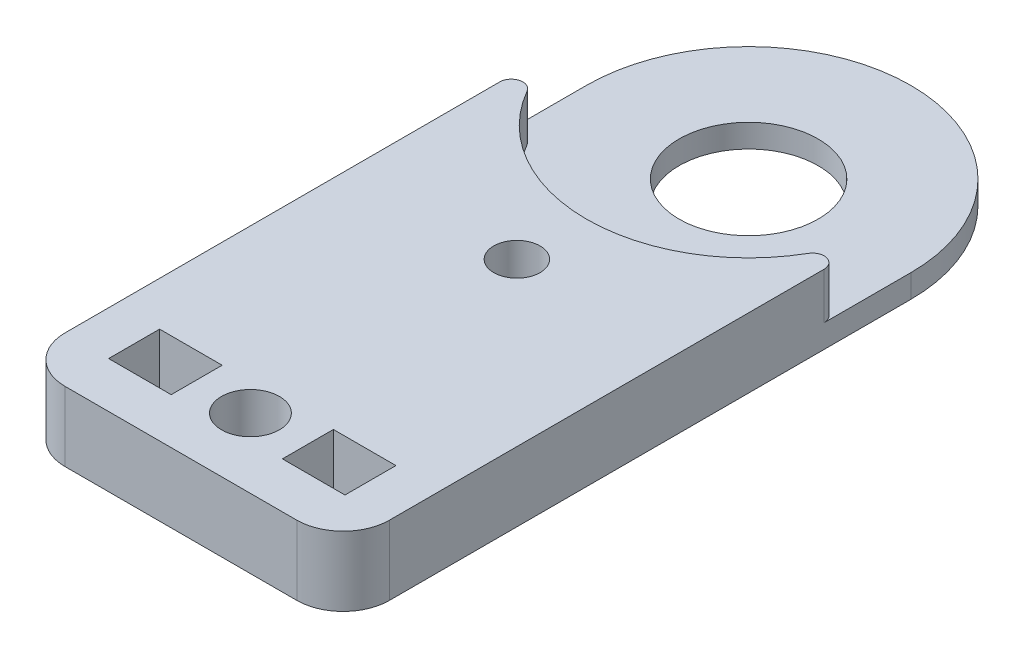
ISO-10303-21;
HEADER;
FILE_DESCRIPTION(('STEP AP214'),'2;1');
FILE_NAME('part.step','',(''),(''),'','','');
FILE_SCHEMA(('AUTOMOTIVE_DESIGN { 1 0 10303 214 1 1 1 1 }'));
ENDSEC;
DATA;
#1=APPLICATION_CONTEXT('core data for automotive mechanical design processes');
#2=APPLICATION_PROTOCOL_DEFINITION('international standard','automotive_design',2000,#1);
#3=PRODUCT_CONTEXT('',#1,'mechanical');
#4=PRODUCT('Part','Part','',(#3));
#5=PRODUCT_RELATED_PRODUCT_CATEGORY('part','',(#4));
#6=PRODUCT_DEFINITION_FORMATION('','',#4);
#7=PRODUCT_DEFINITION_CONTEXT('part definition',#1,'design');
#8=PRODUCT_DEFINITION('design','',#6,#7);
#9=PRODUCT_DEFINITION_SHAPE('','',#8);
#10=(LENGTH_UNIT() NAMED_UNIT(*) SI_UNIT(.MILLI.,.METRE.));
#11=(NAMED_UNIT(*) PLANE_ANGLE_UNIT() SI_UNIT($,.RADIAN.));
#12=(NAMED_UNIT(*) SI_UNIT($,.STERADIAN.) SOLID_ANGLE_UNIT());
#13=UNCERTAINTY_MEASURE_WITH_UNIT(LENGTH_MEASURE(1.E-05),#10,'distance_accuracy_value','');
#14=(GEOMETRIC_REPRESENTATION_CONTEXT(3) GLOBAL_UNCERTAINTY_ASSIGNED_CONTEXT((#13)) GLOBAL_UNIT_ASSIGNED_CONTEXT((#10,
#11,#12)) REPRESENTATION_CONTEXT('',''));
#15=CARTESIAN_POINT('',(0.,0.,0.));
#16=DIRECTION('',(0.,0.,1.));
#17=DIRECTION('',(1.,0.,0.));
#18=AXIS2_PLACEMENT_3D('',#15,#16,#17);
#19=CARTESIAN_POINT('',(0.,1.,-12.25));
#20=DIRECTION('',(0.,-1.,0.));
#21=DIRECTION('',(0.,0.,-1.));
#22=AXIS2_PLACEMENT_3D('',#19,#20,#21);
#23=CYLINDRICAL_SURFACE('',#22,7.);
#24=CARTESIAN_POINT('',(0.,1.,-12.25));
#25=DIRECTION('',(0.,1.,0.));
#26=DIRECTION('',(0.,0.,1.));
#27=AXIS2_PLACEMENT_3D('',#24,#25,#26);
#28=CIRCLE('',#27,7.);
#29=CARTESIAN_POINT('',(7.,1.,-12.25));
#30=VERTEX_POINT('',#29);
#31=CARTESIAN_POINT('',(-7.,1.,-12.25));
#32=VERTEX_POINT('',#31);
#33=EDGE_CURVE('E262',#30,#32,#28,.T.);
#34=ORIENTED_EDGE('',*,*,#33,.F.);
#35=DIRECTION('',(0.,-1.,0.));
#36=VECTOR('',#35,1.);
#37=CARTESIAN_POINT('',(7.,3.,-12.25));
#38=LINE('',#37,#36);
#39=CARTESIAN_POINT('',(7.,0.,-12.25));
#40=VERTEX_POINT('',#39);
#41=EDGE_CURVE('E251',#30,#40,#38,.T.);
#42=ORIENTED_EDGE('',*,*,#41,.T.);
#43=CARTESIAN_POINT('',(0.,0.,-12.25));
#44=DIRECTION('',(0.,1.,0.));
#45=DIRECTION('',(0.,0.,1.));
#46=AXIS2_PLACEMENT_3D('',#43,#44,#45);
#47=CIRCLE('',#46,7.);
#48=CARTESIAN_POINT('',(-7.,0.,-12.25));
#49=VERTEX_POINT('',#48);
#50=EDGE_CURVE('E261',#40,#49,#47,.T.);
#51=ORIENTED_EDGE('',*,*,#50,.T.);
#52=DIRECTION('',(0.,-1.,0.));
#53=VECTOR('',#52,1.);
#54=CARTESIAN_POINT('',(-7.,3.,-12.25));
#55=LINE('',#54,#53);
#56=EDGE_CURVE('E204',#32,#49,#55,.T.);
#57=ORIENTED_EDGE('',*,*,#56,.F.);
#58=EDGE_LOOP('',(#34,#42,#51,#57));
#59=FACE_BOUND('',#58,.T.);
#60=ADVANCED_FACE('F36',(#59),#23,.T.);
#61=CARTESIAN_POINT('',(0.,1.,-12.25));
#62=DIRECTION('',(0.,-1.,0.));
#63=DIRECTION('',(0.,0.,-1.));
#64=AXIS2_PLACEMENT_3D('',#61,#62,#63);
#65=CYLINDRICAL_SURFACE('',#64,3.);
#66=CARTESIAN_POINT('',(0.,1.,-12.25));
#67=DIRECTION('',(0.,1.,0.));
#68=DIRECTION('',(0.,0.,1.));
#69=AXIS2_PLACEMENT_3D('',#66,#67,#68);
#70=CIRCLE('',#69,3.);
#71=CARTESIAN_POINT('',(0.,1.,-9.25));
#72=VERTEX_POINT('',#71);
#73=EDGE_CURVE('E265',#72,#72,#70,.T.);
#74=ORIENTED_EDGE('',*,*,#73,.T.);
#75=EDGE_LOOP('',(#74));
#76=FACE_BOUND('',#75,.T.);
#77=CARTESIAN_POINT('',(0.,0.,-12.25));
#78=DIRECTION('',(0.,1.,0.));
#79=DIRECTION('',(0.,0.,1.));
#80=AXIS2_PLACEMENT_3D('',#77,#78,#79);
#81=CIRCLE('',#80,3.);
#82=CARTESIAN_POINT('',(0.,0.,-9.25));
#83=VERTEX_POINT('',#82);
#84=EDGE_CURVE('E266',#83,#83,#81,.T.);
#85=ORIENTED_EDGE('',*,*,#84,.F.);
#86=EDGE_LOOP('',(#85));
#87=FACE_BOUND('',#86,.T.);
#88=ADVANCED_FACE('F404',(#76,#87),#65,.F.);
#89=CARTESIAN_POINT('',(0.,1.,0.));
#90=DIRECTION('',(0.,1.,0.));
#91=DIRECTION('',(0.,0.,1.));
#92=AXIS2_PLACEMENT_3D('',#89,#90,#91);
#93=PLANE('',#92);
#94=ORIENTED_EDGE('',*,*,#33,.T.);
#95=DIRECTION('',(0.,0.,-1.));
#96=VECTOR('',#95,1.);
#97=CARTESIAN_POINT('',(-7.,1.,0.));
#98=LINE('',#97,#96);
#99=CARTESIAN_POINT('',(-7.,1.,-8.50834261322606));
#100=VERTEX_POINT('',#99);
#101=EDGE_CURVE('E289',#100,#32,#98,.T.);
#102=ORIENTED_EDGE('',*,*,#101,.F.);
#103=CARTESIAN_POINT('',(-6.5,1.,-8.50834261322606));
#104=DIRECTION('',(0.,1.,0.));
#105=DIRECTION('',(0.,0.,1.));
#106=AXIS2_PLACEMENT_3D('',#103,#104,#105);
#107=CIRCLE('',#106,0.5);
#108=CARTESIAN_POINT('',(-6.06666666666667,1.,-8.75778643901099));
#109=VERTEX_POINT('',#108);
#110=EDGE_CURVE('E296',#100,#109,#107,.F.);
#111=ORIENTED_EDGE('',*,*,#110,.T.);
#112=CARTESIAN_POINT('',(0.,1.,-12.25));
#113=DIRECTION('',(0.,1.,0.));
#114=DIRECTION('',(0.,0.,1.));
#115=AXIS2_PLACEMENT_3D('',#112,#113,#114);
#116=CIRCLE('',#115,7.);
#117=CARTESIAN_POINT('',(6.06666666666667,1.,-8.75778643901099));
#118=VERTEX_POINT('',#117);
#119=EDGE_CURVE('E247',#118,#109,#116,.F.);
#120=ORIENTED_EDGE('',*,*,#119,.F.);
#121=CARTESIAN_POINT('',(6.5,1.,-8.50834261322606));
#122=DIRECTION('',(0.,1.,0.));
#123=DIRECTION('',(0.,0.,1.));
#124=AXIS2_PLACEMENT_3D('',#121,#122,#123);
#125=CIRCLE('',#124,0.5);
#126=CARTESIAN_POINT('',(7.,1.,-8.50834261322606));
#127=VERTEX_POINT('',#126);
#128=EDGE_CURVE('E294',#118,#127,#125,.F.);
#129=ORIENTED_EDGE('',*,*,#128,.T.);
#130=DIRECTION('',(0.,0.,1.));
#131=VECTOR('',#130,1.);
#132=CARTESIAN_POINT('',(7.,1.,0.));
#133=LINE('',#132,#131);
#134=EDGE_CURVE('E281',#30,#127,#133,.T.);
#135=ORIENTED_EDGE('',*,*,#134,.F.);
#136=EDGE_LOOP('',(#94,#102,#111,#120,#129,#135));
#137=FACE_BOUND('',#136,.T.);
#138=ORIENTED_EDGE('',*,*,#73,.F.);
#139=EDGE_LOOP('',(#138));
#140=FACE_BOUND('',#139,.T.);
#141=ADVANCED_FACE('F340',(#137,#140),#93,.T.);
#142=CARTESIAN_POINT('',(0.,0.,0.));
#143=DIRECTION('',(0.,1.,0.));
#144=DIRECTION('',(0.,0.,1.));
#145=AXIS2_PLACEMENT_3D('',#142,#143,#144);
#146=PLANE('',#145);
#147=DIRECTION('',(0.,0.,-1.));
#148=VECTOR('',#147,1.);
#149=CARTESIAN_POINT('',(7.,0.,0.));
#150=LINE('',#149,#148);
#151=CARTESIAN_POINT('',(7.,0.,10.25));
#152=VERTEX_POINT('',#151);
#153=EDGE_CURVE('E211',#152,#40,#150,.T.);
#154=ORIENTED_EDGE('',*,*,#153,.F.);
#155=CARTESIAN_POINT('',(5.,0.,10.25));
#156=DIRECTION('',(0.,1.,0.));
#157=DIRECTION('',(0.,0.,1.));
#158=AXIS2_PLACEMENT_3D('',#155,#156,#157);
#159=CIRCLE('',#158,2.);
#160=CARTESIAN_POINT('',(5.,0.,12.25));
#161=VERTEX_POINT('',#160);
#162=EDGE_CURVE('E303',#152,#161,#159,.F.);
#163=ORIENTED_EDGE('',*,*,#162,.T.);
#164=DIRECTION('',(1.,0.,0.));
#165=VECTOR('',#164,1.);
#166=CARTESIAN_POINT('',(0.,0.,12.25));
#167=LINE('',#166,#165);
#168=CARTESIAN_POINT('',(-4.99999999999999,0.,12.25));
#169=VERTEX_POINT('',#168);
#170=EDGE_CURVE('E215',#169,#161,#167,.T.);
#171=ORIENTED_EDGE('',*,*,#170,.F.);
#172=CARTESIAN_POINT('',(-4.99999999999999,0.,10.25));
#173=DIRECTION('',(0.,1.,0.));
#174=DIRECTION('',(0.,0.,1.));
#175=AXIS2_PLACEMENT_3D('',#172,#173,#174);
#176=CIRCLE('',#175,2.);
#177=CARTESIAN_POINT('',(-6.99999999999999,0.,10.25));
#178=VERTEX_POINT('',#177);
#179=EDGE_CURVE('E301',#169,#178,#176,.F.);
#180=ORIENTED_EDGE('',*,*,#179,.T.);
#181=DIRECTION('',(0.,0.,-1.));
#182=VECTOR('',#181,1.);
#183=CARTESIAN_POINT('',(-7.,0.,0.));
#184=LINE('',#183,#182);
#185=EDGE_CURVE('E213',#178,#49,#184,.T.);
#186=ORIENTED_EDGE('',*,*,#185,.T.);
#187=ORIENTED_EDGE('',*,*,#50,.F.);
#188=EDGE_LOOP('',(#154,#163,#171,#180,#186,#187));
#189=FACE_BOUND('',#188,.T.);
#190=ORIENTED_EDGE('',*,*,#84,.T.);
#191=EDGE_LOOP('',(#190));
#192=FACE_BOUND('',#191,.T.);
#193=CARTESIAN_POINT('',(0.,0.,-2.25));
#194=DIRECTION('',(0.,1.,0.));
#195=DIRECTION('',(0.,0.,1.));
#196=AXIS2_PLACEMENT_3D('',#193,#194,#195);
#197=CIRCLE('',#196,1.);
#198=CARTESIAN_POINT('',(0.,0.,-1.25));
#199=VERTEX_POINT('',#198);
#200=EDGE_CURVE('E205',#199,#199,#197,.T.);
#201=ORIENTED_EDGE('',*,*,#200,.T.);
#202=EDGE_LOOP('',(#201));
#203=FACE_BOUND('',#202,.T.);
#204=CARTESIAN_POINT('',(0.,0.,9.25));
#205=DIRECTION('',(0.,1.,0.));
#206=DIRECTION('',(0.,0.,1.));
#207=AXIS2_PLACEMENT_3D('',#204,#205,#206);
#208=CIRCLE('',#207,1.25);
#209=CARTESIAN_POINT('',(0.,0.,10.5));
#210=VERTEX_POINT('',#209);
#211=EDGE_CURVE('E208',#210,#210,#208,.T.);
#212=ORIENTED_EDGE('',*,*,#211,.T.);
#213=EDGE_LOOP('',(#212));
#214=FACE_BOUND('',#213,.T.);
#215=DIRECTION('',(0.,0.,1.));
#216=VECTOR('',#215,1.);
#217=CARTESIAN_POINT('',(-5.1,0.,0.));
#218=LINE('',#217,#216);
#219=CARTESIAN_POINT('',(-5.1,0.,8.07071615635404));
#220=VERTEX_POINT('',#219);
#221=CARTESIAN_POINT('',(-5.1,0.,10.270716156354));
#222=VERTEX_POINT('',#221);
#223=EDGE_CURVE('E167',#220,#222,#218,.T.);
#224=ORIENTED_EDGE('',*,*,#223,.T.);
#225=DIRECTION('',(-1.,0.,0.));
#226=VECTOR('',#225,1.);
#227=CARTESIAN_POINT('',(0.,0.,10.270716156354));
#228=LINE('',#227,#226);
#229=CARTESIAN_POINT('',(-2.4,0.,10.270716156354));
#230=VERTEX_POINT('',#229);
#231=EDGE_CURVE('E223',#230,#222,#228,.T.);
#232=ORIENTED_EDGE('',*,*,#231,.F.);
#233=DIRECTION('',(0.,0.,1.));
#234=VECTOR('',#233,1.);
#235=CARTESIAN_POINT('',(-2.4,0.,0.));
#236=LINE('',#235,#234);
#237=CARTESIAN_POINT('',(-2.4,0.,8.07071615635404));
#238=VERTEX_POINT('',#237);
#239=EDGE_CURVE('E220',#238,#230,#236,.T.);
#240=ORIENTED_EDGE('',*,*,#239,.F.);
#241=DIRECTION('',(-1.,0.,0.));
#242=VECTOR('',#241,1.);
#243=CARTESIAN_POINT('',(0.,0.,8.07071615635404));
#244=LINE('',#243,#242);
#245=EDGE_CURVE('E218',#238,#220,#244,.T.);
#246=ORIENTED_EDGE('',*,*,#245,.T.);
#247=EDGE_LOOP('',(#224,#232,#240,#246));
#248=FACE_BOUND('',#247,.T.);
#249=DIRECTION('',(0.,0.,1.));
#250=VECTOR('',#249,1.);
#251=CARTESIAN_POINT('',(2.40000000000001,0.,0.));
#252=LINE('',#251,#250);
#253=CARTESIAN_POINT('',(2.40000000000001,0.,8.07071615635404));
#254=VERTEX_POINT('',#253);
#255=CARTESIAN_POINT('',(2.40000000000001,0.,10.270716156354));
#256=VERTEX_POINT('',#255);
#257=EDGE_CURVE('E226',#254,#256,#252,.T.);
#258=ORIENTED_EDGE('',*,*,#257,.T.);
#259=DIRECTION('',(1.,0.,0.));
#260=VECTOR('',#259,1.);
#261=CARTESIAN_POINT('',(0.,0.,10.270716156354));
#262=LINE('',#261,#260);
#263=CARTESIAN_POINT('',(5.10000000000001,0.,10.270716156354));
#264=VERTEX_POINT('',#263);
#265=EDGE_CURVE('E235',#256,#264,#262,.T.);
#266=ORIENTED_EDGE('',*,*,#265,.T.);
#267=DIRECTION('',(0.,0.,1.));
#268=VECTOR('',#267,1.);
#269=CARTESIAN_POINT('',(5.10000000000001,0.,0.));
#270=LINE('',#269,#268);
#271=CARTESIAN_POINT('',(5.10000000000001,0.,8.07071615635404));
#272=VERTEX_POINT('',#271);
#273=EDGE_CURVE('E232',#272,#264,#270,.T.);
#274=ORIENTED_EDGE('',*,*,#273,.F.);
#275=DIRECTION('',(1.,0.,0.));
#276=VECTOR('',#275,1.);
#277=CARTESIAN_POINT('',(0.,0.,8.07071615635404));
#278=LINE('',#277,#276);
#279=EDGE_CURVE('E229',#254,#272,#278,.T.);
#280=ORIENTED_EDGE('',*,*,#279,.F.);
#281=EDGE_LOOP('',(#258,#266,#274,#280));
#282=FACE_BOUND('',#281,.T.);
#283=ADVANCED_FACE('F327',(#189,#192,#203,#214,#248,#282),#146,.F.);
#284=CARTESIAN_POINT('',(2.40000000000001,3.,0.));
#285=DIRECTION('',(1.,0.,0.));
#286=DIRECTION('',(0.,0.,-1.));
#287=AXIS2_PLACEMENT_3D('',#284,#285,#286);
#288=PLANE('',#287);
#289=ORIENTED_EDGE('',*,*,#257,.F.);
#290=DIRECTION('',(0.,-1.,0.));
#291=VECTOR('',#290,1.);
#292=CARTESIAN_POINT('',(2.40000000000001,3.,8.07071615635404));
#293=LINE('',#292,#291);
#294=CARTESIAN_POINT('',(2.40000000000001,3.,8.07071615635404));
#295=VERTEX_POINT('',#294);
#296=EDGE_CURVE('E245',#295,#254,#293,.T.);
#297=ORIENTED_EDGE('',*,*,#296,.F.);
#298=DIRECTION('',(0.,0.,1.));
#299=VECTOR('',#298,1.);
#300=CARTESIAN_POINT('',(2.40000000000001,3.,0.));
#301=LINE('',#300,#299);
#302=CARTESIAN_POINT('',(2.40000000000001,3.,10.270716156354));
#303=VERTEX_POINT('',#302);
#304=EDGE_CURVE('E193',#295,#303,#301,.T.);
#305=ORIENTED_EDGE('',*,*,#304,.T.);
#306=DIRECTION('',(0.,-1.,0.));
#307=VECTOR('',#306,1.);
#308=CARTESIAN_POINT('',(2.40000000000001,3.,10.270716156354));
#309=LINE('',#308,#307);
#310=EDGE_CURVE('E172',#303,#256,#309,.T.);
#311=ORIENTED_EDGE('',*,*,#310,.T.);
#312=EDGE_LOOP('',(#289,#297,#305,#311));
#313=FACE_BOUND('',#312,.T.);
#314=ADVANCED_FACE('F379',(#313),#288,.T.);
#315=CARTESIAN_POINT('',(0.,3.,8.07071615635404));
#316=DIRECTION('',(0.,0.,-1.));
#317=DIRECTION('',(-1.,0.,0.));
#318=AXIS2_PLACEMENT_3D('',#315,#316,#317);
#319=PLANE('',#318);
#320=ORIENTED_EDGE('',*,*,#279,.T.);
#321=DIRECTION('',(0.,-1.,0.));
#322=VECTOR('',#321,1.);
#323=CARTESIAN_POINT('',(5.10000000000001,3.,8.07071615635404));
#324=LINE('',#323,#322);
#325=CARTESIAN_POINT('',(5.10000000000001,3.,8.07071615635404));
#326=VERTEX_POINT('',#325);
#327=EDGE_CURVE('E242',#326,#272,#324,.T.);
#328=ORIENTED_EDGE('',*,*,#327,.F.);
#329=DIRECTION('',(1.,0.,0.));
#330=VECTOR('',#329,1.);
#331=CARTESIAN_POINT('',(0.,3.,8.07071615635404));
#332=LINE('',#331,#330);
#333=EDGE_CURVE('E196',#295,#326,#332,.T.);
#334=ORIENTED_EDGE('',*,*,#333,.F.);
#335=ORIENTED_EDGE('',*,*,#296,.T.);
#336=EDGE_LOOP('',(#320,#328,#334,#335));
#337=FACE_BOUND('',#336,.T.);
#338=ADVANCED_FACE('F394',(#337),#319,.F.);
#339=CARTESIAN_POINT('',(5.10000000000001,3.,0.));
#340=DIRECTION('',(1.,0.,0.));
#341=DIRECTION('',(0.,0.,-1.));
#342=AXIS2_PLACEMENT_3D('',#339,#340,#341);
#343=PLANE('',#342);
#344=ORIENTED_EDGE('',*,*,#273,.T.);
#345=DIRECTION('',(0.,-1.,0.));
#346=VECTOR('',#345,1.);
#347=CARTESIAN_POINT('',(5.10000000000001,3.,10.270716156354));
#348=LINE('',#347,#346);
#349=CARTESIAN_POINT('',(5.10000000000001,3.,10.270716156354));
#350=VERTEX_POINT('',#349);
#351=EDGE_CURVE('E240',#350,#264,#348,.T.);
#352=ORIENTED_EDGE('',*,*,#351,.F.);
#353=DIRECTION('',(0.,0.,1.));
#354=VECTOR('',#353,1.);
#355=CARTESIAN_POINT('',(5.10000000000001,3.,0.));
#356=LINE('',#355,#354);
#357=EDGE_CURVE('E199',#326,#350,#356,.T.);
#358=ORIENTED_EDGE('',*,*,#357,.F.);
#359=ORIENTED_EDGE('',*,*,#327,.T.);
#360=EDGE_LOOP('',(#344,#352,#358,#359));
#361=FACE_BOUND('',#360,.T.);
#362=ADVANCED_FACE('F390',(#361),#343,.F.);
#363=CARTESIAN_POINT('',(-5.1,3.,0.));
#364=DIRECTION('',(1.,0.,0.));
#365=DIRECTION('',(0.,0.,-1.));
#366=AXIS2_PLACEMENT_3D('',#363,#364,#365);
#367=PLANE('',#366);
#368=ORIENTED_EDGE('',*,*,#223,.F.);
#369=DIRECTION('',(0.,-1.,0.));
#370=VECTOR('',#369,1.);
#371=CARTESIAN_POINT('',(-5.1,3.,8.07071615635404));
#372=LINE('',#371,#370);
#373=CARTESIAN_POINT('',(-5.1,3.,8.07071615635404));
#374=VERTEX_POINT('',#373);
#375=EDGE_CURVE('E162',#374,#220,#372,.T.);
#376=ORIENTED_EDGE('',*,*,#375,.F.);
#377=DIRECTION('',(0.,0.,1.));
#378=VECTOR('',#377,1.);
#379=CARTESIAN_POINT('',(-5.1,3.,0.));
#380=LINE('',#379,#378);
#381=CARTESIAN_POINT('',(-5.1,3.,10.270716156354));
#382=VERTEX_POINT('',#381);
#383=EDGE_CURVE('E165',#374,#382,#380,.T.);
#384=ORIENTED_EDGE('',*,*,#383,.T.);
#385=DIRECTION('',(0.,-1.,0.));
#386=VECTOR('',#385,1.);
#387=CARTESIAN_POINT('',(-5.1,3.,10.270716156354));
#388=LINE('',#387,#386);
#389=EDGE_CURVE('E248',#382,#222,#388,.T.);
#390=ORIENTED_EDGE('',*,*,#389,.T.);
#391=EDGE_LOOP('',(#368,#376,#384,#390));
#392=FACE_BOUND('',#391,.T.);
#393=ADVANCED_FACE('F164',(#392),#367,.T.);
#394=CARTESIAN_POINT('',(0.,3.,8.07071615635404));
#395=DIRECTION('',(0.,0.,1.));
#396=DIRECTION('',(1.,0.,0.));
#397=AXIS2_PLACEMENT_3D('',#394,#395,#396);
#398=PLANE('',#397);
#399=ORIENTED_EDGE('',*,*,#245,.F.);
#400=DIRECTION('',(0.,-1.,0.));
#401=VECTOR('',#400,1.);
#402=CARTESIAN_POINT('',(-2.4,3.,8.07071615635404));
#403=LINE('',#402,#401);
#404=CARTESIAN_POINT('',(-2.4,3.,8.07071615635404));
#405=VERTEX_POINT('',#404);
#406=EDGE_CURVE('E173',#405,#238,#403,.T.);
#407=ORIENTED_EDGE('',*,*,#406,.F.);
#408=DIRECTION('',(-1.,0.,0.));
#409=VECTOR('',#408,1.);
#410=CARTESIAN_POINT('',(0.,3.,8.07071615635404));
#411=LINE('',#410,#409);
#412=EDGE_CURVE('E180',#405,#374,#411,.T.);
#413=ORIENTED_EDGE('',*,*,#412,.T.);
#414=ORIENTED_EDGE('',*,*,#375,.T.);
#415=EDGE_LOOP('',(#399,#407,#413,#414));
#416=FACE_BOUND('',#415,.T.);
#417=ADVANCED_FACE('F185',(#416),#398,.T.);
#418=CARTESIAN_POINT('',(-2.4,3.,0.));
#419=DIRECTION('',(1.,0.,0.));
#420=DIRECTION('',(0.,0.,-1.));
#421=AXIS2_PLACEMENT_3D('',#418,#419,#420);
#422=PLANE('',#421);
#423=ORIENTED_EDGE('',*,*,#239,.T.);
#424=DIRECTION('',(0.,-1.,0.));
#425=VECTOR('',#424,1.);
#426=CARTESIAN_POINT('',(-2.4,3.,10.270716156354));
#427=LINE('',#426,#425);
#428=CARTESIAN_POINT('',(-2.4,3.,10.270716156354));
#429=VERTEX_POINT('',#428);
#430=EDGE_CURVE('E250',#429,#230,#427,.T.);
#431=ORIENTED_EDGE('',*,*,#430,.F.);
#432=DIRECTION('',(0.,0.,1.));
#433=VECTOR('',#432,1.);
#434=CARTESIAN_POINT('',(-2.4,3.,0.));
#435=LINE('',#434,#433);
#436=EDGE_CURVE('E187',#405,#429,#435,.T.);
#437=ORIENTED_EDGE('',*,*,#436,.F.);
#438=ORIENTED_EDGE('',*,*,#406,.T.);
#439=EDGE_LOOP('',(#423,#431,#437,#438));
#440=FACE_BOUND('',#439,.T.);
#441=ADVANCED_FACE('F468',(#440),#422,.F.);
#442=CARTESIAN_POINT('',(7.,3.,0.));
#443=DIRECTION('',(-1.,0.,0.));
#444=DIRECTION('',(0.,0.,1.));
#445=AXIS2_PLACEMENT_3D('',#442,#443,#444);
#446=PLANE('',#445);
#447=DIRECTION('',(0.,0.,-1.));
#448=VECTOR('',#447,1.);
#449=CARTESIAN_POINT('',(7.,3.,0.));
#450=LINE('',#449,#448);
#451=CARTESIAN_POINT('',(7.,3.,10.25));
#452=VERTEX_POINT('',#451);
#453=CARTESIAN_POINT('',(7.,3.,-8.50834261322606));
#454=VERTEX_POINT('',#453);
#455=EDGE_CURVE('E313',#452,#454,#450,.T.);
#456=ORIENTED_EDGE('',*,*,#455,.F.);
#457=DIRECTION('',(0.,-1.,0.));
#458=VECTOR('',#457,1.);
#459=CARTESIAN_POINT('',(7.,3.,10.25));
#460=LINE('',#459,#458);
#461=EDGE_CURVE('E298',#452,#152,#460,.T.);
#462=ORIENTED_EDGE('',*,*,#461,.T.);
#463=ORIENTED_EDGE('',*,*,#153,.T.);
#464=ORIENTED_EDGE('',*,*,#41,.F.);
#465=ORIENTED_EDGE('',*,*,#134,.T.);
#466=DIRECTION('',(0.,1.,0.));
#467=VECTOR('',#466,1.);
#468=CARTESIAN_POINT('',(7.,3.,-8.50834261322606));
#469=LINE('',#468,#467);
#470=EDGE_CURVE('E278',#127,#454,#469,.T.);
#471=ORIENTED_EDGE('',*,*,#470,.T.);
#472=EDGE_LOOP('',(#456,#462,#463,#464,#465,#471));
#473=FACE_BOUND('',#472,.T.);
#474=ADVANCED_FACE('F317',(#473),#446,.F.);
#475=CARTESIAN_POINT('',(0.,3.,-12.25));
#476=DIRECTION('',(0.,-1.,0.));
#477=DIRECTION('',(0.,0.,-1.));
#478=AXIS2_PLACEMENT_3D('',#475,#476,#477);
#479=CYLINDRICAL_SURFACE('',#478,7.);
#480=CARTESIAN_POINT('',(0.,3.,-12.25));
#481=DIRECTION('',(0.,1.,0.));
#482=DIRECTION('',(0.,0.,1.));
#483=AXIS2_PLACEMENT_3D('',#480,#481,#482);
#484=CIRCLE('',#483,7.);
#485=CARTESIAN_POINT('',(-6.06666666666667,3.,-8.75778643901099));
#486=VERTEX_POINT('',#485);
#487=CARTESIAN_POINT('',(6.06666666666667,3.,-8.75778643901099));
#488=VERTEX_POINT('',#487);
#489=EDGE_CURVE('E321',#486,#488,#484,.T.);
#490=ORIENTED_EDGE('',*,*,#489,.T.);
#491=DIRECTION('',(0.,-1.,0.));
#492=VECTOR('',#491,1.);
#493=CARTESIAN_POINT('',(6.06666666666667,3.,-8.75778643901099));
#494=LINE('',#493,#492);
#495=EDGE_CURVE('E275',#488,#118,#494,.T.);
#496=ORIENTED_EDGE('',*,*,#495,.T.);
#497=ORIENTED_EDGE('',*,*,#119,.T.);
#498=DIRECTION('',(0.,-1.,0.));
#499=VECTOR('',#498,1.);
#500=CARTESIAN_POINT('',(-6.06666666666667,3.,-8.75778643901099));
#501=LINE('',#500,#499);
#502=EDGE_CURVE('E269',#109,#486,#501,.F.);
#503=ORIENTED_EDGE('',*,*,#502,.T.);
#504=EDGE_LOOP('',(#490,#496,#497,#503));
#505=FACE_BOUND('',#504,.T.);
#506=ADVANCED_FACE('F351',(#505),#479,.F.);
#507=CARTESIAN_POINT('',(-7.,3.,0.));
#508=DIRECTION('',(-1.,0.,0.));
#509=DIRECTION('',(0.,0.,1.));
#510=AXIS2_PLACEMENT_3D('',#507,#508,#509);
#511=PLANE('',#510);
#512=ORIENTED_EDGE('',*,*,#185,.F.);
#513=DIRECTION('',(0.,-1.,0.));
#514=VECTOR('',#513,1.);
#515=CARTESIAN_POINT('',(-6.99999999999999,3.,10.25));
#516=LINE('',#515,#514);
#517=CARTESIAN_POINT('',(-6.99999999999999,3.,10.25));
#518=VERTEX_POINT('',#517);
#519=EDGE_CURVE('E11',#178,#518,#516,.F.);
#520=ORIENTED_EDGE('',*,*,#519,.T.);
#521=DIRECTION('',(0.,0.,-1.));
#522=VECTOR('',#521,1.);
#523=CARTESIAN_POINT('',(-7.,3.,0.));
#524=LINE('',#523,#522);
#525=CARTESIAN_POINT('',(-7.,3.,-8.50834261322606));
#526=VERTEX_POINT('',#525);
#527=EDGE_CURVE('E353',#518,#526,#524,.T.);
#528=ORIENTED_EDGE('',*,*,#527,.T.);
#529=DIRECTION('',(0.,-1.,0.));
#530=VECTOR('',#529,1.);
#531=CARTESIAN_POINT('',(-7.,3.,-8.50834261322606));
#532=LINE('',#531,#530);
#533=EDGE_CURVE('E291',#526,#100,#532,.T.);
#534=ORIENTED_EDGE('',*,*,#533,.T.);
#535=ORIENTED_EDGE('',*,*,#101,.T.);
#536=ORIENTED_EDGE('',*,*,#56,.T.);
#537=EDGE_LOOP('',(#512,#520,#528,#534,#535,#536));
#538=FACE_BOUND('',#537,.T.);
#539=ADVANCED_FACE('F334',(#538),#511,.T.);
#540=CARTESIAN_POINT('',(0.,3.,10.270716156354));
#541=DIRECTION('',(0.,0.,1.));
#542=DIRECTION('',(1.,0.,0.));
#543=AXIS2_PLACEMENT_3D('',#540,#541,#542);
#544=PLANE('',#543);
#545=ORIENTED_EDGE('',*,*,#231,.T.);
#546=ORIENTED_EDGE('',*,*,#389,.F.);
#547=DIRECTION('',(-1.,0.,0.));
#548=VECTOR('',#547,1.);
#549=CARTESIAN_POINT('',(0.,3.,10.270716156354));
#550=LINE('',#549,#548);
#551=EDGE_CURVE('E181',#429,#382,#550,.T.);
#552=ORIENTED_EDGE('',*,*,#551,.F.);
#553=ORIENTED_EDGE('',*,*,#430,.T.);
#554=EDGE_LOOP('',(#545,#546,#552,#553));
#555=FACE_BOUND('',#554,.T.);
#556=ADVANCED_FACE('F446',(#555),#544,.F.);
#557=CARTESIAN_POINT('',(0.,3.,12.25));
#558=DIRECTION('',(0.,0.,-1.));
#559=DIRECTION('',(-1.,0.,0.));
#560=AXIS2_PLACEMENT_3D('',#557,#558,#559);
#561=PLANE('',#560);
#562=ORIENTED_EDGE('',*,*,#170,.T.);
#563=DIRECTION('',(0.,-1.,0.));
#564=VECTOR('',#563,1.);
#565=CARTESIAN_POINT('',(5.,3.,12.25));
#566=LINE('',#565,#564);
#567=CARTESIAN_POINT('',(5.,3.,12.25));
#568=VERTEX_POINT('',#567);
#569=EDGE_CURVE('E57',#161,#568,#566,.F.);
#570=ORIENTED_EDGE('',*,*,#569,.T.);
#571=DIRECTION('',(1.,0.,0.));
#572=VECTOR('',#571,1.);
#573=CARTESIAN_POINT('',(0.,3.,12.25));
#574=LINE('',#573,#572);
#575=CARTESIAN_POINT('',(-4.99999999999999,3.,12.25));
#576=VERTEX_POINT('',#575);
#577=EDGE_CURVE('E183',#576,#568,#574,.T.);
#578=ORIENTED_EDGE('',*,*,#577,.F.);
#579=DIRECTION('',(0.,-1.,0.));
#580=VECTOR('',#579,1.);
#581=CARTESIAN_POINT('',(-4.99999999999999,0.,12.25));
#582=LINE('',#581,#580);
#583=EDGE_CURVE('E305',#576,#169,#582,.T.);
#584=ORIENTED_EDGE('',*,*,#583,.T.);
#585=EDGE_LOOP('',(#562,#570,#578,#584));
#586=FACE_BOUND('',#585,.T.);
#587=ADVANCED_FACE('F330',(#586),#561,.F.);
#588=CARTESIAN_POINT('',(0.,3.,9.25));
#589=DIRECTION('',(0.,-1.,0.));
#590=DIRECTION('',(0.,0.,-1.));
#591=AXIS2_PLACEMENT_3D('',#588,#589,#590);
#592=CYLINDRICAL_SURFACE('',#591,1.25);
#593=CARTESIAN_POINT('',(0.,3.,9.25));
#594=DIRECTION('',(0.,1.,0.));
#595=DIRECTION('',(0.,0.,1.));
#596=AXIS2_PLACEMENT_3D('',#593,#594,#595);
#597=CIRCLE('',#596,1.25);
#598=CARTESIAN_POINT('',(0.,3.,10.5));
#599=VERTEX_POINT('',#598);
#600=EDGE_CURVE('E322',#599,#599,#597,.T.);
#601=ORIENTED_EDGE('',*,*,#600,.T.);
#602=EDGE_LOOP('',(#601));
#603=FACE_BOUND('',#602,.T.);
#604=ORIENTED_EDGE('',*,*,#211,.F.);
#605=EDGE_LOOP('',(#604));
#606=FACE_BOUND('',#605,.T.);
#607=ADVANCED_FACE('F371',(#603,#606),#592,.F.);
#608=CARTESIAN_POINT('',(0.,3.,-2.25));
#609=DIRECTION('',(0.,-1.,0.));
#610=DIRECTION('',(0.,0.,-1.));
#611=AXIS2_PLACEMENT_3D('',#608,#609,#610);
#612=CYLINDRICAL_SURFACE('',#611,1.);
#613=CARTESIAN_POINT('',(0.,3.,-2.25));
#614=DIRECTION('',(0.,1.,0.));
#615=DIRECTION('',(0.,0.,1.));
#616=AXIS2_PLACEMENT_3D('',#613,#614,#615);
#617=CIRCLE('',#616,1.);
#618=CARTESIAN_POINT('',(0.,3.,-1.25));
#619=VERTEX_POINT('',#618);
#620=EDGE_CURVE('E238',#619,#619,#617,.T.);
#621=ORIENTED_EDGE('',*,*,#620,.T.);
#622=EDGE_LOOP('',(#621));
#623=FACE_BOUND('',#622,.T.);
#624=ORIENTED_EDGE('',*,*,#200,.F.);
#625=EDGE_LOOP('',(#624));
#626=FACE_BOUND('',#625,.T.);
#627=ADVANCED_FACE('F362',(#623,#626),#612,.F.);
#628=CARTESIAN_POINT('',(0.,3.,10.270716156354));
#629=DIRECTION('',(0.,0.,-1.));
#630=DIRECTION('',(-1.,0.,0.));
#631=AXIS2_PLACEMENT_3D('',#628,#629,#630);
#632=PLANE('',#631);
#633=ORIENTED_EDGE('',*,*,#265,.F.);
#634=ORIENTED_EDGE('',*,*,#310,.F.);
#635=DIRECTION('',(1.,0.,0.));
#636=VECTOR('',#635,1.);
#637=CARTESIAN_POINT('',(0.,3.,10.270716156354));
#638=LINE('',#637,#636);
#639=EDGE_CURVE('E201',#303,#350,#638,.T.);
#640=ORIENTED_EDGE('',*,*,#639,.T.);
#641=ORIENTED_EDGE('',*,*,#351,.T.);
#642=EDGE_LOOP('',(#633,#634,#640,#641));
#643=FACE_BOUND('',#642,.T.);
#644=ADVANCED_FACE('F367',(#643),#632,.T.);
#645=CARTESIAN_POINT('',(0.,3.,0.));
#646=DIRECTION('',(0.,1.,0.));
#647=DIRECTION('',(0.,0.,1.));
#648=AXIS2_PLACEMENT_3D('',#645,#646,#647);
#649=PLANE('',#648);
#650=ORIENTED_EDGE('',*,*,#620,.F.);
#651=EDGE_LOOP('',(#650));
#652=FACE_BOUND('',#651,.T.);
#653=ORIENTED_EDGE('',*,*,#600,.F.);
#654=EDGE_LOOP('',(#653));
#655=FACE_BOUND('',#654,.T.);
#656=ORIENTED_EDGE('',*,*,#577,.T.);
#657=CARTESIAN_POINT('',(5.,3.,10.25));
#658=DIRECTION('',(0.,1.,0.));
#659=DIRECTION('',(0.,0.,1.));
#660=AXIS2_PLACEMENT_3D('',#657,#658,#659);
#661=CIRCLE('',#660,2.);
#662=EDGE_CURVE('E44',#568,#452,#661,.T.);
#663=ORIENTED_EDGE('',*,*,#662,.T.);
#664=ORIENTED_EDGE('',*,*,#455,.T.);
#665=CARTESIAN_POINT('',(6.5,3.,-8.50834261322606));
#666=DIRECTION('',(0.,1.,0.));
#667=DIRECTION('',(0.,0.,1.));
#668=AXIS2_PLACEMENT_3D('',#665,#666,#667);
#669=CIRCLE('',#668,0.5);
#670=EDGE_CURVE('E287',#454,#488,#669,.T.);
#671=ORIENTED_EDGE('',*,*,#670,.T.);
#672=ORIENTED_EDGE('',*,*,#489,.F.);
#673=CARTESIAN_POINT('',(-6.5,3.,-8.50834261322606));
#674=DIRECTION('',(0.,1.,0.));
#675=DIRECTION('',(0.,0.,1.));
#676=AXIS2_PLACEMENT_3D('',#673,#674,#675);
#677=CIRCLE('',#676,0.5);
#678=EDGE_CURVE('E284',#486,#526,#677,.T.);
#679=ORIENTED_EDGE('',*,*,#678,.T.);
#680=ORIENTED_EDGE('',*,*,#527,.F.);
#681=CARTESIAN_POINT('',(-4.99999999999999,3.,10.25));
#682=DIRECTION('',(0.,1.,0.));
#683=DIRECTION('',(0.,0.,1.));
#684=AXIS2_PLACEMENT_3D('',#681,#682,#683);
#685=CIRCLE('',#684,2.);
#686=EDGE_CURVE('E309',#518,#576,#685,.T.);
#687=ORIENTED_EDGE('',*,*,#686,.T.);
#688=EDGE_LOOP('',(#656,#663,#664,#671,#672,#679,#680,#687));
#689=FACE_BOUND('',#688,.T.);
#690=ORIENTED_EDGE('',*,*,#383,.F.);
#691=ORIENTED_EDGE('',*,*,#412,.F.);
#692=ORIENTED_EDGE('',*,*,#436,.T.);
#693=ORIENTED_EDGE('',*,*,#551,.T.);
#694=EDGE_LOOP('',(#690,#691,#692,#693));
#695=FACE_BOUND('',#694,.T.);
#696=ORIENTED_EDGE('',*,*,#304,.F.);
#697=ORIENTED_EDGE('',*,*,#333,.T.);
#698=ORIENTED_EDGE('',*,*,#357,.T.);
#699=ORIENTED_EDGE('',*,*,#639,.F.);
#700=EDGE_LOOP('',(#696,#697,#698,#699));
#701=FACE_BOUND('',#700,.T.);
#702=ADVANCED_FACE('F177',(#652,#655,#689,#695,#701),#649,.T.);
#703=CARTESIAN_POINT('',(6.5,3.,-8.50834261322606));
#704=DIRECTION('',(0.,-1.,0.));
#705=DIRECTION('',(0.,0.,-1.));
#706=AXIS2_PLACEMENT_3D('',#703,#704,#705);
#707=CYLINDRICAL_SURFACE('',#706,0.5);
#708=ORIENTED_EDGE('',*,*,#670,.F.);
#709=ORIENTED_EDGE('',*,*,#470,.F.);
#710=ORIENTED_EDGE('',*,*,#128,.F.);
#711=ORIENTED_EDGE('',*,*,#495,.F.);
#712=EDGE_LOOP('',(#708,#709,#710,#711));
#713=FACE_BOUND('',#712,.T.);
#714=ADVANCED_FACE('F345',(#713),#707,.T.);
#715=CARTESIAN_POINT('',(-6.5,3.,-8.50834261322606));
#716=DIRECTION('',(0.,-1.,0.));
#717=DIRECTION('',(0.,0.,-1.));
#718=AXIS2_PLACEMENT_3D('',#715,#716,#717);
#719=CYLINDRICAL_SURFACE('',#718,0.5);
#720=ORIENTED_EDGE('',*,*,#678,.F.);
#721=ORIENTED_EDGE('',*,*,#502,.F.);
#722=ORIENTED_EDGE('',*,*,#110,.F.);
#723=ORIENTED_EDGE('',*,*,#533,.F.);
#724=EDGE_LOOP('',(#720,#721,#722,#723));
#725=FACE_BOUND('',#724,.T.);
#726=ADVANCED_FACE('F414',(#725),#719,.T.);
#727=CARTESIAN_POINT('',(5.,3.,10.25));
#728=DIRECTION('',(0.,-1.,0.));
#729=DIRECTION('',(0.,0.,-1.));
#730=AXIS2_PLACEMENT_3D('',#727,#728,#729);
#731=CYLINDRICAL_SURFACE('',#730,2.);
#732=ORIENTED_EDGE('',*,*,#662,.F.);
#733=ORIENTED_EDGE('',*,*,#569,.F.);
#734=ORIENTED_EDGE('',*,*,#162,.F.);
#735=ORIENTED_EDGE('',*,*,#461,.F.);
#736=EDGE_LOOP('',(#732,#733,#734,#735));
#737=FACE_BOUND('',#736,.T.);
#738=ADVANCED_FACE('F324',(#737),#731,.T.);
#739=CARTESIAN_POINT('',(-4.99999999999999,3.,10.25));
#740=DIRECTION('',(0.,1.,0.));
#741=DIRECTION('',(0.,0.,1.));
#742=AXIS2_PLACEMENT_3D('',#739,#740,#741);
#743=CYLINDRICAL_SURFACE('',#742,2.);
#744=ORIENTED_EDGE('',*,*,#686,.F.);
#745=ORIENTED_EDGE('',*,*,#519,.F.);
#746=ORIENTED_EDGE('',*,*,#179,.F.);
#747=ORIENTED_EDGE('',*,*,#583,.F.);
#748=EDGE_LOOP('',(#744,#745,#746,#747));
#749=FACE_BOUND('',#748,.T.);
#750=ADVANCED_FACE('F38',(#749),#743,.T.);
#751=CLOSED_SHELL('',(#60,#88,#141,#283,#314,#338,#362,#393,#417,#441,#474,#506,#539,#556,#587,
#607,#627,#644,#702,#714,#726,#738,#750));
#752=MANIFOLD_SOLID_BREP('B2',#751);
#753=ADVANCED_BREP_SHAPE_REPRESENTATION('',(#18,#752),#14);
#754=SHAPE_DEFINITION_REPRESENTATION(#9,#753);
ENDSEC;
END-ISO-10303-21;
